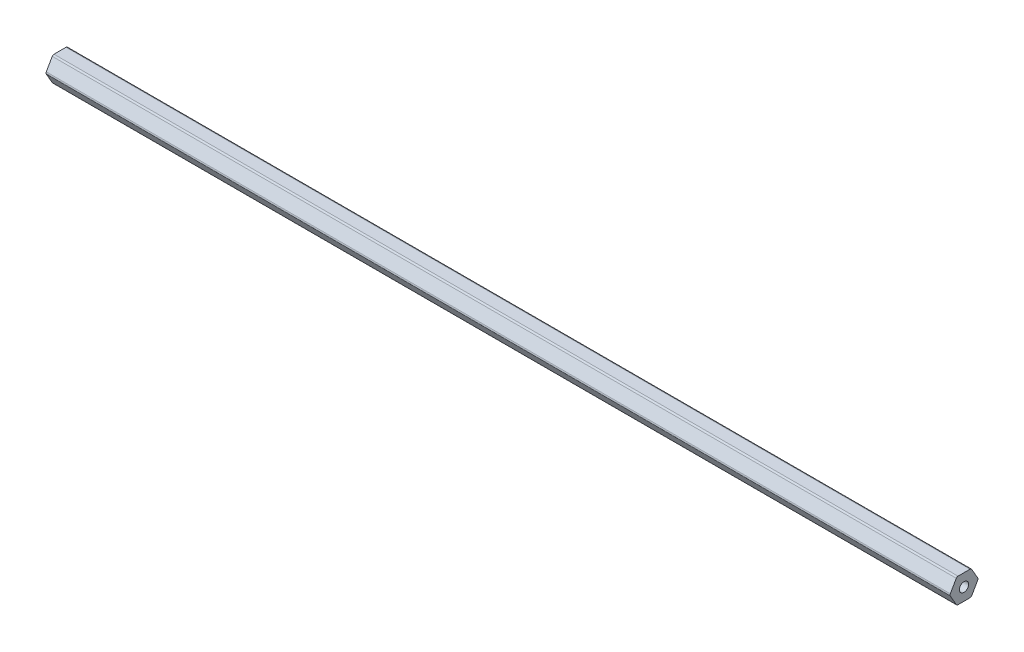
ISO-10303-21;
HEADER;
FILE_DESCRIPTION(('STEP AP214'),'2;1');
FILE_NAME('part.step','',(''),(''),'','','');
FILE_SCHEMA(('AUTOMOTIVE_DESIGN { 1 0 10303 214 1 1 1 1 }'));
ENDSEC;
DATA;
#1=APPLICATION_CONTEXT('core data for automotive mechanical design processes');
#2=APPLICATION_PROTOCOL_DEFINITION('international standard','automotive_design',2000,#1);
#3=PRODUCT_CONTEXT('',#1,'mechanical');
#4=PRODUCT('Part','Part','',(#3));
#5=PRODUCT_RELATED_PRODUCT_CATEGORY('part','',(#4));
#6=PRODUCT_DEFINITION_FORMATION('','',#4);
#7=PRODUCT_DEFINITION_CONTEXT('part definition',#1,'design');
#8=PRODUCT_DEFINITION('design','',#6,#7);
#9=PRODUCT_DEFINITION_SHAPE('','',#8);
#10=(LENGTH_UNIT() NAMED_UNIT(*) SI_UNIT(.MILLI.,.METRE.));
#11=(NAMED_UNIT(*) PLANE_ANGLE_UNIT() SI_UNIT($,.RADIAN.));
#12=(NAMED_UNIT(*) SI_UNIT($,.STERADIAN.) SOLID_ANGLE_UNIT());
#13=UNCERTAINTY_MEASURE_WITH_UNIT(LENGTH_MEASURE(1.E-05),#10,'distance_accuracy_value','');
#14=(GEOMETRIC_REPRESENTATION_CONTEXT(3) GLOBAL_UNCERTAINTY_ASSIGNED_CONTEXT((#13)) GLOBAL_UNIT_ASSIGNED_CONTEXT((#10,
#11,#12)) REPRESENTATION_CONTEXT('',''));
#15=CARTESIAN_POINT('',(0.,0.,0.));
#16=DIRECTION('',(0.,0.,1.));
#17=DIRECTION('',(1.,0.,0.));
#18=AXIS2_PLACEMENT_3D('',#15,#16,#17);
#19=CARTESIAN_POINT('',(-231.775,5.334,-3.07958633585748));
#20=DIRECTION('',(1.,0.,0.));
#21=DIRECTION('',(0.,0.,-1.));
#22=AXIS2_PLACEMENT_3D('',#19,#20,#21);
#23=CYLINDRICAL_SURFACE('',#22,1.016);
#24=DIRECTION('',(1.,0.,0.));
#25=VECTOR('',#24,1.);
#26=CARTESIAN_POINT('',(-231.775,6.34999999999999,-3.07958633585748));
#27=LINE('',#26,#25);
#28=CARTESIAN_POINT('',(-231.775,6.34999999999999,-3.07958633585748));
#29=VERTEX_POINT('',#28);
#30=CARTESIAN_POINT('',(231.775,6.34999999999999,-3.07958633585748));
#31=VERTEX_POINT('',#30);
#32=EDGE_CURVE('E43',#29,#31,#27,.T.);
#33=ORIENTED_EDGE('',*,*,#32,.T.);
#34=CARTESIAN_POINT('',(231.775,5.334,-3.07958633585748));
#35=DIRECTION('',(1.,0.,0.));
#36=DIRECTION('',(0.,0.,1.));
#37=AXIS2_PLACEMENT_3D('',#34,#35,#36);
#38=CIRCLE('',#37,1.016);
#39=CARTESIAN_POINT('',(231.775,5.84199999999999,-3.95946814610247));
#40=VERTEX_POINT('',#39);
#41=EDGE_CURVE('E128',#40,#31,#38,.T.);
#42=ORIENTED_EDGE('',*,*,#41,.F.);
#43=DIRECTION('',(1.,0.,0.));
#44=VECTOR('',#43,1.);
#45=CARTESIAN_POINT('',(-231.775,5.84199999999999,-3.95946814610247));
#46=LINE('',#45,#44);
#47=CARTESIAN_POINT('',(-231.775,5.84199999999999,-3.95946814610247));
#48=VERTEX_POINT('',#47);
#49=EDGE_CURVE('E11',#48,#40,#46,.T.);
#50=ORIENTED_EDGE('',*,*,#49,.F.);
#51=CARTESIAN_POINT('',(-231.775,5.334,-3.07958633585748));
#52=DIRECTION('',(1.,0.,0.));
#53=DIRECTION('',(0.,0.,1.));
#54=AXIS2_PLACEMENT_3D('',#51,#52,#53);
#55=CIRCLE('',#54,1.016);
#56=EDGE_CURVE('E129',#48,#29,#55,.T.);
#57=ORIENTED_EDGE('',*,*,#56,.T.);
#58=EDGE_LOOP('',(#33,#42,#50,#57));
#59=FACE_BOUND('',#58,.T.);
#60=ADVANCED_FACE('F40',(#59),#23,.T.);
#61=CARTESIAN_POINT('',(-231.775,0.50799999999998,-7.03905448195992));
#62=DIRECTION('',(0.,0.499999999999997,-0.86602540378444));
#63=DIRECTION('',(0.,0.86602540378444,0.499999999999997));
#64=AXIS2_PLACEMENT_3D('',#61,#62,#63);
#65=PLANE('',#64);
#66=ORIENTED_EDGE('',*,*,#49,.T.);
#67=DIRECTION('',(0.,0.86602540378444,0.499999999999997));
#68=VECTOR('',#67,1.);
#69=CARTESIAN_POINT('',(231.775,0.50799999999998,-7.03905448195992));
#70=LINE('',#69,#68);
#71=CARTESIAN_POINT('',(231.775,0.507999999999981,-7.03905448195992));
#72=VERTEX_POINT('',#71);
#73=EDGE_CURVE('E147',#72,#40,#70,.T.);
#74=ORIENTED_EDGE('',*,*,#73,.F.);
#75=DIRECTION('',(1.,0.,0.));
#76=VECTOR('',#75,1.);
#77=CARTESIAN_POINT('',(-231.775,0.507999999999981,-7.03905448195992));
#78=LINE('',#77,#76);
#79=CARTESIAN_POINT('',(-231.775,0.507999999999981,-7.03905448195992));
#80=VERTEX_POINT('',#79);
#81=EDGE_CURVE('E48',#80,#72,#78,.T.);
#82=ORIENTED_EDGE('',*,*,#81,.F.);
#83=DIRECTION('',(0.,0.86602540378444,0.499999999999997));
#84=VECTOR('',#83,1.);
#85=CARTESIAN_POINT('',(-231.775,0.50799999999998,-7.03905448195992));
#86=LINE('',#85,#84);
#87=EDGE_CURVE('E134',#80,#48,#86,.T.);
#88=ORIENTED_EDGE('',*,*,#87,.T.);
#89=EDGE_LOOP('',(#66,#74,#82,#88));
#90=FACE_BOUND('',#89,.T.);
#91=ADVANCED_FACE('F265',(#90),#65,.T.);
#92=CARTESIAN_POINT('',(-231.775,0.,-6.15917267171493));
#93=DIRECTION('',(1.,0.,0.));
#94=DIRECTION('',(0.,0.,-1.));
#95=AXIS2_PLACEMENT_3D('',#92,#93,#94);
#96=CYLINDRICAL_SURFACE('',#95,1.016);
#97=ORIENTED_EDGE('',*,*,#81,.T.);
#98=CARTESIAN_POINT('',(231.775,0.,-6.15917267171493));
#99=DIRECTION('',(1.,0.,0.));
#100=DIRECTION('',(0.,0.,1.));
#101=AXIS2_PLACEMENT_3D('',#98,#99,#100);
#102=CIRCLE('',#101,1.016);
#103=CARTESIAN_POINT('',(231.775,-0.508000000000019,-7.03905448195992));
#104=VERTEX_POINT('',#103);
#105=EDGE_CURVE('E175',#104,#72,#102,.T.);
#106=ORIENTED_EDGE('',*,*,#105,.F.);
#107=DIRECTION('',(1.,0.,0.));
#108=VECTOR('',#107,1.);
#109=CARTESIAN_POINT('',(-231.775,-0.508000000000019,-7.03905448195992));
#110=LINE('',#109,#108);
#111=CARTESIAN_POINT('',(-231.775,-0.508000000000019,-7.03905448195992));
#112=VERTEX_POINT('',#111);
#113=EDGE_CURVE('E212',#112,#104,#110,.T.);
#114=ORIENTED_EDGE('',*,*,#113,.F.);
#115=CARTESIAN_POINT('',(-231.775,0.,-6.15917267171493));
#116=DIRECTION('',(1.,0.,0.));
#117=DIRECTION('',(0.,0.,1.));
#118=AXIS2_PLACEMENT_3D('',#115,#116,#117);
#119=CIRCLE('',#118,1.016);
#120=EDGE_CURVE('E208',#112,#80,#119,.T.);
#121=ORIENTED_EDGE('',*,*,#120,.T.);
#122=EDGE_LOOP('',(#97,#106,#114,#121));
#123=FACE_BOUND('',#122,.T.);
#124=ADVANCED_FACE('F263',(#123),#96,.T.);
#125=CARTESIAN_POINT('',(-231.775,-5.84200000000001,-3.95946814610244));
#126=DIRECTION('',(0.,-0.500000000000002,-0.866025403784437));
#127=DIRECTION('',(0.,0.866025403784437,-0.500000000000003));
#128=AXIS2_PLACEMENT_3D('',#125,#126,#127);
#129=PLANE('',#128);
#130=ORIENTED_EDGE('',*,*,#113,.T.);
#131=DIRECTION('',(0.,0.866025403784437,-0.500000000000002));
#132=VECTOR('',#131,1.);
#133=CARTESIAN_POINT('',(231.775,-5.84200000000001,-3.95946814610244));
#134=LINE('',#133,#132);
#135=CARTESIAN_POINT('',(231.775,-5.84200000000001,-3.95946814610244));
#136=VERTEX_POINT('',#135);
#137=EDGE_CURVE('E172',#136,#104,#134,.T.);
#138=ORIENTED_EDGE('',*,*,#137,.F.);
#139=DIRECTION('',(1.,0.,0.));
#140=VECTOR('',#139,1.);
#141=CARTESIAN_POINT('',(-231.775,-5.84200000000001,-3.95946814610244));
#142=LINE('',#141,#140);
#143=CARTESIAN_POINT('',(-231.775,-5.84200000000001,-3.95946814610244));
#144=VERTEX_POINT('',#143);
#145=EDGE_CURVE('E214',#144,#136,#142,.T.);
#146=ORIENTED_EDGE('',*,*,#145,.F.);
#147=DIRECTION('',(0.,0.866025403784437,-0.500000000000002));
#148=VECTOR('',#147,1.);
#149=CARTESIAN_POINT('',(-231.775,-5.84200000000001,-3.95946814610244));
#150=LINE('',#149,#148);
#151=EDGE_CURVE('E205',#144,#112,#150,.T.);
#152=ORIENTED_EDGE('',*,*,#151,.T.);
#153=EDGE_LOOP('',(#130,#138,#146,#152));
#154=FACE_BOUND('',#153,.T.);
#155=ADVANCED_FACE('F261',(#154),#129,.T.);
#156=CARTESIAN_POINT('',(-231.775,-5.33400000000001,-3.07958633585745));
#157=DIRECTION('',(1.,0.,0.));
#158=DIRECTION('',(0.,0.,-1.));
#159=AXIS2_PLACEMENT_3D('',#156,#157,#158);
#160=CYLINDRICAL_SURFACE('',#159,1.016);
#161=ORIENTED_EDGE('',*,*,#145,.T.);
#162=CARTESIAN_POINT('',(231.775,-5.33400000000001,-3.07958633585745));
#163=DIRECTION('',(1.,0.,0.));
#164=DIRECTION('',(0.,0.,1.));
#165=AXIS2_PLACEMENT_3D('',#162,#163,#164);
#166=CIRCLE('',#165,1.016);
#167=CARTESIAN_POINT('',(231.775,-6.35000000000001,-3.07958633585745));
#168=VERTEX_POINT('',#167);
#169=EDGE_CURVE('E169',#168,#136,#166,.T.);
#170=ORIENTED_EDGE('',*,*,#169,.F.);
#171=DIRECTION('',(1.,0.,0.));
#172=VECTOR('',#171,1.);
#173=CARTESIAN_POINT('',(-231.775,-6.35000000000001,-3.07958633585745));
#174=LINE('',#173,#172);
#175=CARTESIAN_POINT('',(-231.775,-6.35000000000001,-3.07958633585745));
#176=VERTEX_POINT('',#175);
#177=EDGE_CURVE('E216',#176,#168,#174,.T.);
#178=ORIENTED_EDGE('',*,*,#177,.F.);
#179=CARTESIAN_POINT('',(-231.775,-5.33400000000001,-3.07958633585745));
#180=DIRECTION('',(1.,0.,0.));
#181=DIRECTION('',(0.,0.,1.));
#182=AXIS2_PLACEMENT_3D('',#179,#180,#181);
#183=CIRCLE('',#182,1.016);
#184=EDGE_CURVE('E202',#176,#144,#183,.T.);
#185=ORIENTED_EDGE('',*,*,#184,.T.);
#186=EDGE_LOOP('',(#161,#170,#178,#185));
#187=FACE_BOUND('',#186,.T.);
#188=ADVANCED_FACE('F256',(#187),#160,.T.);
#189=CARTESIAN_POINT('',(-231.775,-6.35,3.07958633585748));
#190=DIRECTION('',(0.,-1.,0.));
#191=DIRECTION('',(0.,0.,-1.));
#192=AXIS2_PLACEMENT_3D('',#189,#190,#191);
#193=PLANE('',#192);
#194=ORIENTED_EDGE('',*,*,#177,.T.);
#195=DIRECTION('',(0.,0.,-1.));
#196=VECTOR('',#195,1.);
#197=CARTESIAN_POINT('',(231.775,-6.35,3.07958633585748));
#198=LINE('',#197,#196);
#199=CARTESIAN_POINT('',(231.775,-6.35,3.07958633585748));
#200=VERTEX_POINT('',#199);
#201=EDGE_CURVE('E166',#200,#168,#198,.T.);
#202=ORIENTED_EDGE('',*,*,#201,.F.);
#203=DIRECTION('',(1.,0.,0.));
#204=VECTOR('',#203,1.);
#205=CARTESIAN_POINT('',(-231.775,-6.35,3.07958633585748));
#206=LINE('',#205,#204);
#207=CARTESIAN_POINT('',(-231.775,-6.35,3.07958633585748));
#208=VERTEX_POINT('',#207);
#209=EDGE_CURVE('E218',#208,#200,#206,.T.);
#210=ORIENTED_EDGE('',*,*,#209,.F.);
#211=DIRECTION('',(0.,0.,-1.));
#212=VECTOR('',#211,1.);
#213=CARTESIAN_POINT('',(-231.775,-6.35,3.07958633585748));
#214=LINE('',#213,#212);
#215=EDGE_CURVE('E199',#208,#176,#214,.T.);
#216=ORIENTED_EDGE('',*,*,#215,.T.);
#217=EDGE_LOOP('',(#194,#202,#210,#216));
#218=FACE_BOUND('',#217,.T.);
#219=ADVANCED_FACE('F251',(#218),#193,.T.);
#220=CARTESIAN_POINT('',(-231.775,-5.334,3.07958633585748));
#221=DIRECTION('',(1.,0.,0.));
#222=DIRECTION('',(0.,0.,-1.));
#223=AXIS2_PLACEMENT_3D('',#220,#221,#222);
#224=CYLINDRICAL_SURFACE('',#223,1.016);
#225=ORIENTED_EDGE('',*,*,#209,.T.);
#226=CARTESIAN_POINT('',(231.775,-5.334,3.07958633585748));
#227=DIRECTION('',(1.,0.,0.));
#228=DIRECTION('',(0.,0.,1.));
#229=AXIS2_PLACEMENT_3D('',#226,#227,#228);
#230=CIRCLE('',#229,1.016);
#231=CARTESIAN_POINT('',(231.775,-5.84199999999999,3.95946814610247));
#232=VERTEX_POINT('',#231);
#233=EDGE_CURVE('E163',#232,#200,#230,.T.);
#234=ORIENTED_EDGE('',*,*,#233,.F.);
#235=DIRECTION('',(1.,0.,0.));
#236=VECTOR('',#235,1.);
#237=CARTESIAN_POINT('',(-231.775,-5.84199999999999,3.95946814610247));
#238=LINE('',#237,#236);
#239=CARTESIAN_POINT('',(-231.775,-5.84199999999999,3.95946814610247));
#240=VERTEX_POINT('',#239);
#241=EDGE_CURVE('E220',#240,#232,#238,.T.);
#242=ORIENTED_EDGE('',*,*,#241,.F.);
#243=CARTESIAN_POINT('',(-231.775,-5.334,3.07958633585748));
#244=DIRECTION('',(1.,0.,0.));
#245=DIRECTION('',(0.,0.,1.));
#246=AXIS2_PLACEMENT_3D('',#243,#244,#245);
#247=CIRCLE('',#246,1.016);
#248=EDGE_CURVE('E196',#240,#208,#247,.T.);
#249=ORIENTED_EDGE('',*,*,#248,.T.);
#250=EDGE_LOOP('',(#225,#234,#242,#249));
#251=FACE_BOUND('',#250,.T.);
#252=ADVANCED_FACE('F249',(#251),#224,.T.);
#253=CARTESIAN_POINT('',(-231.775,-0.507999999999979,7.03905448195992));
#254=DIRECTION('',(0.,-0.499999999999998,0.86602540378444));
#255=DIRECTION('',(0.,-0.86602540378444,-0.499999999999998));
#256=AXIS2_PLACEMENT_3D('',#253,#254,#255);
#257=PLANE('',#256);
#258=ORIENTED_EDGE('',*,*,#241,.T.);
#259=DIRECTION('',(0.,-0.86602540378444,-0.499999999999998));
#260=VECTOR('',#259,1.);
#261=CARTESIAN_POINT('',(231.775,-0.507999999999979,7.03905448195992));
#262=LINE('',#261,#260);
#263=CARTESIAN_POINT('',(231.775,-0.50799999999998,7.03905448195993));
#264=VERTEX_POINT('',#263);
#265=EDGE_CURVE('E160',#264,#232,#262,.T.);
#266=ORIENTED_EDGE('',*,*,#265,.F.);
#267=DIRECTION('',(1.,0.,0.));
#268=VECTOR('',#267,1.);
#269=CARTESIAN_POINT('',(-231.775,-0.50799999999998,7.03905448195993));
#270=LINE('',#269,#268);
#271=CARTESIAN_POINT('',(-231.775,-0.50799999999998,7.03905448195993));
#272=VERTEX_POINT('',#271);
#273=EDGE_CURVE('E222',#272,#264,#270,.T.);
#274=ORIENTED_EDGE('',*,*,#273,.F.);
#275=DIRECTION('',(0.,-0.86602540378444,-0.499999999999998));
#276=VECTOR('',#275,1.);
#277=CARTESIAN_POINT('',(-231.775,-0.507999999999979,7.03905448195992));
#278=LINE('',#277,#276);
#279=EDGE_CURVE('E193',#272,#240,#278,.T.);
#280=ORIENTED_EDGE('',*,*,#279,.T.);
#281=EDGE_LOOP('',(#258,#266,#274,#280));
#282=FACE_BOUND('',#281,.T.);
#283=ADVANCED_FACE('F244',(#282),#257,.T.);
#284=CARTESIAN_POINT('',(-231.775,0.,6.15917267171493));
#285=DIRECTION('',(1.,0.,0.));
#286=DIRECTION('',(0.,0.,-1.));
#287=AXIS2_PLACEMENT_3D('',#284,#285,#286);
#288=CYLINDRICAL_SURFACE('',#287,1.016);
#289=ORIENTED_EDGE('',*,*,#273,.T.);
#290=CARTESIAN_POINT('',(231.775,0.,6.15917267171493));
#291=DIRECTION('',(1.,0.,0.));
#292=DIRECTION('',(0.,0.,1.));
#293=AXIS2_PLACEMENT_3D('',#290,#291,#292);
#294=CIRCLE('',#293,1.016);
#295=CARTESIAN_POINT('',(231.775,0.508000000000022,7.03905448195992));
#296=VERTEX_POINT('',#295);
#297=EDGE_CURVE('E157',#296,#264,#294,.T.);
#298=ORIENTED_EDGE('',*,*,#297,.F.);
#299=DIRECTION('',(1.,0.,0.));
#300=VECTOR('',#299,1.);
#301=CARTESIAN_POINT('',(-231.775,0.508000000000022,7.03905448195992));
#302=LINE('',#301,#300);
#303=CARTESIAN_POINT('',(-231.775,0.508000000000022,7.03905448195992));
#304=VERTEX_POINT('',#303);
#305=EDGE_CURVE('E224',#304,#296,#302,.T.);
#306=ORIENTED_EDGE('',*,*,#305,.F.);
#307=CARTESIAN_POINT('',(-231.775,0.,6.15917267171493));
#308=DIRECTION('',(1.,0.,0.));
#309=DIRECTION('',(0.,0.,1.));
#310=AXIS2_PLACEMENT_3D('',#307,#308,#309);
#311=CIRCLE('',#310,1.016);
#312=EDGE_CURVE('E190',#304,#272,#311,.T.);
#313=ORIENTED_EDGE('',*,*,#312,.T.);
#314=EDGE_LOOP('',(#289,#298,#306,#313));
#315=FACE_BOUND('',#314,.T.);
#316=ADVANCED_FACE('F237',(#315),#288,.T.);
#317=CARTESIAN_POINT('',(-231.775,5.84200000000001,3.95946814610244));
#318=DIRECTION('',(0.,0.500000000000003,0.866025403784437));
#319=DIRECTION('',(0.,-0.866025403784437,0.500000000000003));
#320=AXIS2_PLACEMENT_3D('',#317,#318,#319);
#321=PLANE('',#320);
#322=ORIENTED_EDGE('',*,*,#305,.T.);
#323=DIRECTION('',(0.,-0.866025403784437,0.500000000000003));
#324=VECTOR('',#323,1.);
#325=CARTESIAN_POINT('',(231.775,5.84200000000001,3.95946814610244));
#326=LINE('',#325,#324);
#327=CARTESIAN_POINT('',(231.775,5.84200000000001,3.95946814610244));
#328=VERTEX_POINT('',#327);
#329=EDGE_CURVE('E154',#328,#296,#326,.T.);
#330=ORIENTED_EDGE('',*,*,#329,.F.);
#331=DIRECTION('',(1.,0.,0.));
#332=VECTOR('',#331,1.);
#333=CARTESIAN_POINT('',(-231.775,5.84200000000001,3.95946814610244));
#334=LINE('',#333,#332);
#335=CARTESIAN_POINT('',(-231.775,5.84200000000001,3.95946814610244));
#336=VERTEX_POINT('',#335);
#337=EDGE_CURVE('E226',#336,#328,#334,.T.);
#338=ORIENTED_EDGE('',*,*,#337,.F.);
#339=DIRECTION('',(0.,-0.866025403784437,0.500000000000003));
#340=VECTOR('',#339,1.);
#341=CARTESIAN_POINT('',(-231.775,5.84200000000001,3.95946814610244));
#342=LINE('',#341,#340);
#343=EDGE_CURVE('E187',#336,#304,#342,.T.);
#344=ORIENTED_EDGE('',*,*,#343,.T.);
#345=EDGE_LOOP('',(#322,#330,#338,#344));
#346=FACE_BOUND('',#345,.T.);
#347=ADVANCED_FACE('F234',(#346),#321,.T.);
#348=CARTESIAN_POINT('',(-231.775,5.33400000000001,3.07958633585745));
#349=DIRECTION('',(1.,0.,0.));
#350=DIRECTION('',(0.,0.,-1.));
#351=AXIS2_PLACEMENT_3D('',#348,#349,#350);
#352=CYLINDRICAL_SURFACE('',#351,1.016);
#353=ORIENTED_EDGE('',*,*,#337,.T.);
#354=CARTESIAN_POINT('',(231.775,5.33400000000001,3.07958633585745));
#355=DIRECTION('',(1.,0.,0.));
#356=DIRECTION('',(0.,0.,1.));
#357=AXIS2_PLACEMENT_3D('',#354,#355,#356);
#358=CIRCLE('',#357,1.016);
#359=CARTESIAN_POINT('',(231.775,6.35000000000001,3.07958633585745));
#360=VERTEX_POINT('',#359);
#361=EDGE_CURVE('E141',#360,#328,#358,.T.);
#362=ORIENTED_EDGE('',*,*,#361,.F.);
#363=DIRECTION('',(1.,0.,0.));
#364=VECTOR('',#363,1.);
#365=CARTESIAN_POINT('',(-231.775,6.35000000000001,3.07958633585745));
#366=LINE('',#365,#364);
#367=CARTESIAN_POINT('',(-231.775,6.35000000000001,3.07958633585745));
#368=VERTEX_POINT('',#367);
#369=EDGE_CURVE('E133',#368,#360,#366,.T.);
#370=ORIENTED_EDGE('',*,*,#369,.F.);
#371=CARTESIAN_POINT('',(-231.775,5.33400000000001,3.07958633585745));
#372=DIRECTION('',(1.,0.,0.));
#373=DIRECTION('',(0.,0.,1.));
#374=AXIS2_PLACEMENT_3D('',#371,#372,#373);
#375=CIRCLE('',#374,1.016);
#376=EDGE_CURVE('E184',#368,#336,#375,.T.);
#377=ORIENTED_EDGE('',*,*,#376,.T.);
#378=EDGE_LOOP('',(#353,#362,#370,#377));
#379=FACE_BOUND('',#378,.T.);
#380=ADVANCED_FACE('F228',(#379),#352,.T.);
#381=CARTESIAN_POINT('',(-231.775,6.34999999999999,-3.07958633585748));
#382=DIRECTION('',(0.,1.,0.));
#383=DIRECTION('',(0.,0.,1.));
#384=AXIS2_PLACEMENT_3D('',#381,#382,#383);
#385=PLANE('',#384);
#386=ORIENTED_EDGE('',*,*,#369,.T.);
#387=DIRECTION('',(0.,0.,1.));
#388=VECTOR('',#387,1.);
#389=CARTESIAN_POINT('',(231.775,6.34999999999999,-3.07958633585748));
#390=LINE('',#389,#388);
#391=EDGE_CURVE('E136',#31,#360,#390,.T.);
#392=ORIENTED_EDGE('',*,*,#391,.F.);
#393=ORIENTED_EDGE('',*,*,#32,.F.);
#394=DIRECTION('',(0.,0.,1.));
#395=VECTOR('',#394,1.);
#396=CARTESIAN_POINT('',(-231.775,6.34999999999999,-3.07958633585748));
#397=LINE('',#396,#395);
#398=EDGE_CURVE('E182',#29,#368,#397,.T.);
#399=ORIENTED_EDGE('',*,*,#398,.T.);
#400=EDGE_LOOP('',(#386,#392,#393,#399));
#401=FACE_BOUND('',#400,.T.);
#402=ADVANCED_FACE('F137',(#401),#385,.T.);
#403=CARTESIAN_POINT('',(-231.775,5.334,-3.07958633585748));
#404=DIRECTION('',(-1.,0.,0.));
#405=DIRECTION('',(0.,0.,1.));
#406=AXIS2_PLACEMENT_3D('',#403,#404,#405);
#407=PLANE('',#406);
#408=CARTESIAN_POINT('',(-231.775,0.,0.));
#409=DIRECTION('',(1.,0.,0.));
#410=DIRECTION('',(0.,0.,-1.));
#411=AXIS2_PLACEMENT_3D('',#408,#409,#410);
#412=CIRCLE('',#411,2.38125);
#413=CARTESIAN_POINT('',(-231.775,0.,-2.38125));
#414=VERTEX_POINT('',#413);
#415=EDGE_CURVE('E178',#414,#414,#412,.T.);
#416=ORIENTED_EDGE('',*,*,#415,.T.);
#417=EDGE_LOOP('',(#416));
#418=FACE_BOUND('',#417,.T.);
#419=ORIENTED_EDGE('',*,*,#56,.F.);
#420=ORIENTED_EDGE('',*,*,#87,.F.);
#421=ORIENTED_EDGE('',*,*,#120,.F.);
#422=ORIENTED_EDGE('',*,*,#151,.F.);
#423=ORIENTED_EDGE('',*,*,#184,.F.);
#424=ORIENTED_EDGE('',*,*,#215,.F.);
#425=ORIENTED_EDGE('',*,*,#248,.F.);
#426=ORIENTED_EDGE('',*,*,#279,.F.);
#427=ORIENTED_EDGE('',*,*,#312,.F.);
#428=ORIENTED_EDGE('',*,*,#343,.F.);
#429=ORIENTED_EDGE('',*,*,#376,.F.);
#430=ORIENTED_EDGE('',*,*,#398,.F.);
#431=EDGE_LOOP('',(#419,#420,#421,#422,#423,#424,#425,#426,#427,#428,#429,#430));
#432=FACE_BOUND('',#431,.T.);
#433=ADVANCED_FACE('F240',(#418,#432),#407,.T.);
#434=CARTESIAN_POINT('',(-231.775,0.,0.));
#435=DIRECTION('',(1.,0.,0.));
#436=DIRECTION('',(0.,0.,-1.));
#437=AXIS2_PLACEMENT_3D('',#434,#435,#436);
#438=CYLINDRICAL_SURFACE('',#437,2.38125);
#439=ORIENTED_EDGE('',*,*,#415,.F.);
#440=EDGE_LOOP('',(#439));
#441=FACE_BOUND('',#440,.T.);
#442=CARTESIAN_POINT('',(231.775,0.,0.));
#443=DIRECTION('',(1.,0.,0.));
#444=DIRECTION('',(0.,0.,-1.));
#445=AXIS2_PLACEMENT_3D('',#442,#443,#444);
#446=CIRCLE('',#445,2.38125);
#447=CARTESIAN_POINT('',(231.775,0.,-2.38125));
#448=VERTEX_POINT('',#447);
#449=EDGE_CURVE('E148',#448,#448,#446,.T.);
#450=ORIENTED_EDGE('',*,*,#449,.T.);
#451=EDGE_LOOP('',(#450));
#452=FACE_BOUND('',#451,.T.);
#453=ADVANCED_FACE('F295',(#441,#452),#438,.F.);
#454=CARTESIAN_POINT('',(231.775,5.334,-3.07958633585748));
#455=DIRECTION('',(-1.,0.,0.));
#456=DIRECTION('',(0.,0.,1.));
#457=AXIS2_PLACEMENT_3D('',#454,#455,#456);
#458=PLANE('',#457);
#459=ORIENTED_EDGE('',*,*,#41,.T.);
#460=ORIENTED_EDGE('',*,*,#391,.T.);
#461=ORIENTED_EDGE('',*,*,#361,.T.);
#462=ORIENTED_EDGE('',*,*,#329,.T.);
#463=ORIENTED_EDGE('',*,*,#297,.T.);
#464=ORIENTED_EDGE('',*,*,#265,.T.);
#465=ORIENTED_EDGE('',*,*,#233,.T.);
#466=ORIENTED_EDGE('',*,*,#201,.T.);
#467=ORIENTED_EDGE('',*,*,#169,.T.);
#468=ORIENTED_EDGE('',*,*,#137,.T.);
#469=ORIENTED_EDGE('',*,*,#105,.T.);
#470=ORIENTED_EDGE('',*,*,#73,.T.);
#471=EDGE_LOOP('',(#459,#460,#461,#462,#463,#464,#465,#466,#467,#468,#469,#470));
#472=FACE_BOUND('',#471,.T.);
#473=ORIENTED_EDGE('',*,*,#449,.F.);
#474=EDGE_LOOP('',(#473));
#475=FACE_BOUND('',#474,.T.);
#476=ADVANCED_FACE('F144',(#472,#475),#458,.F.);
#477=CLOSED_SHELL('',(#60,#91,#124,#155,#188,#219,#252,#283,#316,#347,#380,#402,#433,#453,#476));
#478=MANIFOLD_SOLID_BREP('B2',#477);
#479=ADVANCED_BREP_SHAPE_REPRESENTATION('',(#18,#478),#14);
#480=SHAPE_DEFINITION_REPRESENTATION(#9,#479);
ENDSEC;
END-ISO-10303-21;
